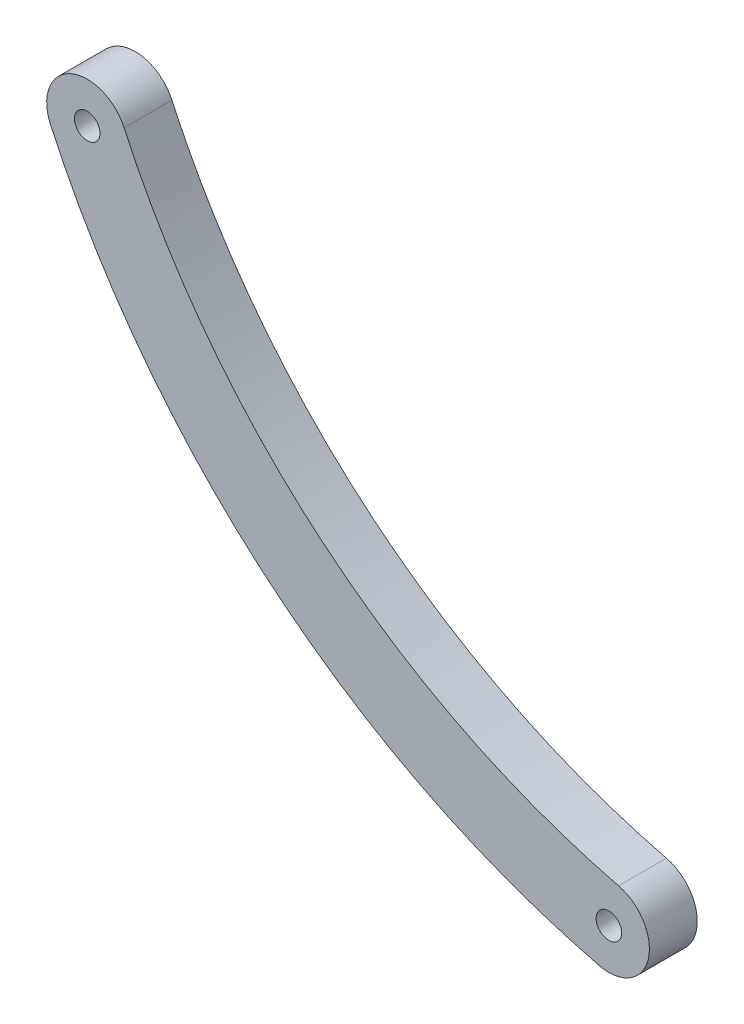
ISO-10303-21;
HEADER;
FILE_DESCRIPTION(('STEP AP214'),'2;1');
FILE_NAME('part.step','',(''),(''),'','','');
FILE_SCHEMA(('AUTOMOTIVE_DESIGN { 1 0 10303 214 1 1 1 1 }'));
ENDSEC;
DATA;
#1=APPLICATION_CONTEXT('core data for automotive mechanical design processes');
#2=APPLICATION_PROTOCOL_DEFINITION('international standard','automotive_design',2000,#1);
#3=PRODUCT_CONTEXT('',#1,'mechanical');
#4=PRODUCT('Part','Part','',(#3));
#5=PRODUCT_RELATED_PRODUCT_CATEGORY('part','',(#4));
#6=PRODUCT_DEFINITION_FORMATION('','',#4);
#7=PRODUCT_DEFINITION_CONTEXT('part definition',#1,'design');
#8=PRODUCT_DEFINITION('design','',#6,#7);
#9=PRODUCT_DEFINITION_SHAPE('','',#8);
#10=(LENGTH_UNIT() NAMED_UNIT(*) SI_UNIT(.MILLI.,.METRE.));
#11=(NAMED_UNIT(*) PLANE_ANGLE_UNIT() SI_UNIT($,.RADIAN.));
#12=(NAMED_UNIT(*) SI_UNIT($,.STERADIAN.) SOLID_ANGLE_UNIT());
#13=UNCERTAINTY_MEASURE_WITH_UNIT(LENGTH_MEASURE(1.E-05),#10,'distance_accuracy_value','');
#14=(GEOMETRIC_REPRESENTATION_CONTEXT(3) GLOBAL_UNCERTAINTY_ASSIGNED_CONTEXT((#13)) GLOBAL_UNIT_ASSIGNED_CONTEXT((#10,
#11,#12)) REPRESENTATION_CONTEXT('',''));
#15=CARTESIAN_POINT('',(0.,0.,0.));
#16=DIRECTION('',(0.,0.,1.));
#17=DIRECTION('',(1.,0.,0.));
#18=AXIS2_PLACEMENT_3D('',#15,#16,#17);
#19=CARTESIAN_POINT('',(198.044221934487,188.107028272022,5.9944));
#20=DIRECTION('',(0.,0.,1.));
#21=DIRECTION('',(1.,0.,0.));
#22=AXIS2_PLACEMENT_3D('',#19,#20,#21);
#23=PLANE('',#22);
#24=CARTESIAN_POINT('',(153.726206500026,167.826140047074,5.9944));
#25=DIRECTION('',(0.,0.,1.));
#26=DIRECTION('',(1.,0.,0.));
#27=AXIS2_PLACEMENT_3D('',#24,#25,#26);
#28=CIRCLE('',#27,1.60000000000066);
#29=CARTESIAN_POINT('',(155.326206500027,167.826140047074,5.9944));
#30=VERTEX_POINT('',#29);
#31=EDGE_CURVE('E99',#30,#30,#28,.T.);
#32=ORIENTED_EDGE('',*,*,#31,.F.);
#33=EDGE_LOOP('',(#32));
#34=FACE_BOUND('',#33,.T.);
#35=CARTESIAN_POINT('',(153.726206500026,167.826140047074,5.9944));
#36=DIRECTION('',(0.,0.,1.));
#37=DIRECTION('',(1.,0.,0.));
#38=AXIS2_PLACEMENT_3D('',#35,#36,#37);
#39=CIRCLE('',#38,5.08);
#40=CARTESIAN_POINT('',(158.345499992818,169.940029265423,5.9944));
#41=VERTEX_POINT('',#40);
#42=CARTESIAN_POINT('',(149.106913007235,165.712250828725,5.9944));
#43=VERTEX_POINT('',#42);
#44=EDGE_CURVE('E84',#41,#43,#39,.T.);
#45=ORIENTED_EDGE('',*,*,#44,.T.);
#46=CARTESIAN_POINT('',(242.362237368947,208.387916496971,5.9944));
#47=DIRECTION('',(0.,0.,1.));
#48=DIRECTION('',(1.,0.,0.));
#49=AXIS2_PLACEMENT_3D('',#46,#47,#48);
#50=CIRCLE('',#49,102.556169790198);
#51=CARTESIAN_POINT('',(217.866778032363,108.800063653736,5.9944));
#52=VERTEX_POINT('',#51);
#53=EDGE_CURVE('E79',#43,#52,#50,.T.);
#54=ORIENTED_EDGE('',*,*,#53,.T.);
#55=CARTESIAN_POINT('',(219.080131979613,113.733031543221,5.9944));
#56=DIRECTION('',(0.,0.,1.));
#57=DIRECTION('',(1.,0.,0.));
#58=AXIS2_PLACEMENT_3D('',#55,#56,#57);
#59=CIRCLE('',#58,5.08000000000001);
#60=CARTESIAN_POINT('',(220.293485926864,118.665999432706,5.9944));
#61=VERTEX_POINT('',#60);
#62=EDGE_CURVE('E82',#52,#61,#59,.T.);
#63=ORIENTED_EDGE('',*,*,#62,.T.);
#64=CARTESIAN_POINT('',(242.362237368947,208.387916496971,5.9944));
#65=DIRECTION('',(0.,0.,-1.));
#66=DIRECTION('',(1.,0.,0.));
#67=AXIS2_PLACEMENT_3D('',#64,#65,#66);
#68=CIRCLE('',#67,92.3961697901981);
#69=EDGE_CURVE('E49',#61,#41,#68,.T.);
#70=ORIENTED_EDGE('',*,*,#69,.T.);
#71=EDGE_LOOP('',(#45,#54,#63,#70));
#72=FACE_BOUND('',#71,.T.);
#73=CARTESIAN_POINT('',(219.080131979613,113.733031543221,5.9944));
#74=DIRECTION('',(0.,0.,1.));
#75=DIRECTION('',(1.,0.,0.));
#76=AXIS2_PLACEMENT_3D('',#73,#74,#75);
#77=CIRCLE('',#76,1.59999997498833);
#78=CARTESIAN_POINT('',(220.680131954602,113.733031543221,5.9944));
#79=VERTEX_POINT('',#78);
#80=EDGE_CURVE('E114',#79,#79,#77,.T.);
#81=ORIENTED_EDGE('',*,*,#80,.F.);
#82=EDGE_LOOP('',(#81));
#83=FACE_BOUND('',#82,.T.);
#84=ADVANCED_FACE('F32',(#34,#72,#83),#23,.T.);
#85=CARTESIAN_POINT('',(198.044221934487,188.107028272022,0.));
#86=DIRECTION('',(0.,0.,1.));
#87=DIRECTION('',(1.,0.,0.));
#88=AXIS2_PLACEMENT_3D('',#85,#86,#87);
#89=PLANE('',#88);
#90=CARTESIAN_POINT('',(153.726206500026,167.826140047074,0.));
#91=DIRECTION('',(0.,0.,1.));
#92=DIRECTION('',(1.,0.,0.));
#93=AXIS2_PLACEMENT_3D('',#90,#91,#92);
#94=CIRCLE('',#93,5.08);
#95=CARTESIAN_POINT('',(158.345499992818,169.940029265423,0.));
#96=VERTEX_POINT('',#95);
#97=CARTESIAN_POINT('',(149.106913007235,165.712250828725,0.));
#98=VERTEX_POINT('',#97);
#99=EDGE_CURVE('E96',#96,#98,#94,.T.);
#100=ORIENTED_EDGE('',*,*,#99,.F.);
#101=CARTESIAN_POINT('',(242.362237368947,208.387916496971,0.));
#102=DIRECTION('',(0.,0.,-1.));
#103=DIRECTION('',(1.,0.,0.));
#104=AXIS2_PLACEMENT_3D('',#101,#102,#103);
#105=CIRCLE('',#104,92.3961697901981);
#106=CARTESIAN_POINT('',(220.293485926864,118.665999432706,0.));
#107=VERTEX_POINT('',#106);
#108=EDGE_CURVE('E72',#107,#96,#105,.T.);
#109=ORIENTED_EDGE('',*,*,#108,.F.);
#110=CARTESIAN_POINT('',(219.080131979613,113.733031543221,0.));
#111=DIRECTION('',(0.,0.,1.));
#112=DIRECTION('',(1.,0.,0.));
#113=AXIS2_PLACEMENT_3D('',#110,#111,#112);
#114=CIRCLE('',#113,5.08000000000001);
#115=CARTESIAN_POINT('',(217.866778032363,108.800063653736,0.));
#116=VERTEX_POINT('',#115);
#117=EDGE_CURVE('E66',#116,#107,#114,.T.);
#118=ORIENTED_EDGE('',*,*,#117,.F.);
#119=CARTESIAN_POINT('',(242.362237368947,208.387916496971,0.));
#120=DIRECTION('',(0.,0.,1.));
#121=DIRECTION('',(1.,0.,0.));
#122=AXIS2_PLACEMENT_3D('',#119,#120,#121);
#123=CIRCLE('',#122,102.556169790198);
#124=EDGE_CURVE('E88',#98,#116,#123,.T.);
#125=ORIENTED_EDGE('',*,*,#124,.F.);
#126=EDGE_LOOP('',(#100,#109,#118,#125));
#127=FACE_BOUND('',#126,.T.);
#128=CARTESIAN_POINT('',(153.726206500026,167.826140047074,0.));
#129=DIRECTION('',(0.,0.,1.));
#130=DIRECTION('',(1.,0.,0.));
#131=AXIS2_PLACEMENT_3D('',#128,#129,#130);
#132=CIRCLE('',#131,1.60000000000066);
#133=CARTESIAN_POINT('',(155.326206500027,167.826140047074,0.));
#134=VERTEX_POINT('',#133);
#135=EDGE_CURVE('E111',#134,#134,#132,.T.);
#136=ORIENTED_EDGE('',*,*,#135,.T.);
#137=EDGE_LOOP('',(#136));
#138=FACE_BOUND('',#137,.T.);
#139=CARTESIAN_POINT('',(219.080131979613,113.733031543221,0.));
#140=DIRECTION('',(0.,0.,1.));
#141=DIRECTION('',(1.,0.,0.));
#142=AXIS2_PLACEMENT_3D('',#139,#140,#141);
#143=CIRCLE('',#142,1.59999997498833);
#144=CARTESIAN_POINT('',(220.680131954602,113.733031543221,0.));
#145=VERTEX_POINT('',#144);
#146=EDGE_CURVE('E117',#145,#145,#143,.T.);
#147=ORIENTED_EDGE('',*,*,#146,.T.);
#148=EDGE_LOOP('',(#147));
#149=FACE_BOUND('',#148,.T.);
#150=ADVANCED_FACE('F107',(#127,#138,#149),#89,.F.);
#151=CARTESIAN_POINT('',(153.726206500026,167.826140047074,5.9944));
#152=DIRECTION('',(0.,0.,-1.));
#153=DIRECTION('',(-1.,0.,0.));
#154=AXIS2_PLACEMENT_3D('',#151,#152,#153);
#155=CYLINDRICAL_SURFACE('',#154,5.08);
#156=ORIENTED_EDGE('',*,*,#99,.T.);
#157=DIRECTION('',(0.,0.,-1.));
#158=VECTOR('',#157,1.);
#159=CARTESIAN_POINT('',(149.106913007235,165.712250828725,5.9944));
#160=LINE('',#159,#158);
#161=EDGE_CURVE('E11',#43,#98,#160,.T.);
#162=ORIENTED_EDGE('',*,*,#161,.F.);
#163=ORIENTED_EDGE('',*,*,#44,.F.);
#164=DIRECTION('',(0.,0.,-1.));
#165=VECTOR('',#164,1.);
#166=CARTESIAN_POINT('',(158.345499992818,169.940029265423,5.9944));
#167=LINE('',#166,#165);
#168=EDGE_CURVE('E92',#41,#96,#167,.T.);
#169=ORIENTED_EDGE('',*,*,#168,.T.);
#170=EDGE_LOOP('',(#156,#162,#163,#169));
#171=FACE_BOUND('',#170,.T.);
#172=ADVANCED_FACE('F34',(#171),#155,.T.);
#173=CARTESIAN_POINT('',(242.362237368947,208.387916496971,5.9944));
#174=DIRECTION('',(0.,0.,-1.));
#175=DIRECTION('',(-1.,0.,0.));
#176=AXIS2_PLACEMENT_3D('',#173,#174,#175);
#177=CYLINDRICAL_SURFACE('',#176,102.556169790198);
#178=ORIENTED_EDGE('',*,*,#124,.T.);
#179=DIRECTION('',(0.,0.,-1.));
#180=VECTOR('',#179,1.);
#181=CARTESIAN_POINT('',(217.866778032363,108.800063653736,5.9944));
#182=LINE('',#181,#180);
#183=EDGE_CURVE('E41',#52,#116,#182,.T.);
#184=ORIENTED_EDGE('',*,*,#183,.F.);
#185=ORIENTED_EDGE('',*,*,#53,.F.);
#186=ORIENTED_EDGE('',*,*,#161,.T.);
#187=EDGE_LOOP('',(#178,#184,#185,#186));
#188=FACE_BOUND('',#187,.T.);
#189=ADVANCED_FACE('F87',(#188),#177,.T.);
#190=CARTESIAN_POINT('',(219.080131979613,113.733031543221,5.9944));
#191=DIRECTION('',(0.,0.,-1.));
#192=DIRECTION('',(-1.,0.,0.));
#193=AXIS2_PLACEMENT_3D('',#190,#191,#192);
#194=CYLINDRICAL_SURFACE('',#193,5.08000000000001);
#195=ORIENTED_EDGE('',*,*,#117,.T.);
#196=DIRECTION('',(0.,0.,-1.));
#197=VECTOR('',#196,1.);
#198=CARTESIAN_POINT('',(220.293485926864,118.665999432706,5.9944));
#199=LINE('',#198,#197);
#200=EDGE_CURVE('E89',#61,#107,#199,.T.);
#201=ORIENTED_EDGE('',*,*,#200,.F.);
#202=ORIENTED_EDGE('',*,*,#62,.F.);
#203=ORIENTED_EDGE('',*,*,#183,.T.);
#204=EDGE_LOOP('',(#195,#201,#202,#203));
#205=FACE_BOUND('',#204,.T.);
#206=ADVANCED_FACE('F90',(#205),#194,.T.);
#207=CARTESIAN_POINT('',(242.362237368947,208.387916496971,5.9944));
#208=DIRECTION('',(0.,0.,-1.));
#209=DIRECTION('',(-1.,0.,0.));
#210=AXIS2_PLACEMENT_3D('',#207,#208,#209);
#211=CYLINDRICAL_SURFACE('',#210,92.3961697901981);
#212=ORIENTED_EDGE('',*,*,#108,.T.);
#213=ORIENTED_EDGE('',*,*,#168,.F.);
#214=ORIENTED_EDGE('',*,*,#69,.F.);
#215=ORIENTED_EDGE('',*,*,#200,.T.);
#216=EDGE_LOOP('',(#212,#213,#214,#215));
#217=FACE_BOUND('',#216,.T.);
#218=ADVANCED_FACE('F104',(#217),#211,.F.);
#219=CARTESIAN_POINT('',(153.726206500026,167.826140047074,5.9944));
#220=DIRECTION('',(0.,0.,-1.));
#221=DIRECTION('',(-1.,0.,0.));
#222=AXIS2_PLACEMENT_3D('',#219,#220,#221);
#223=CYLINDRICAL_SURFACE('',#222,1.60000000000066);
#224=ORIENTED_EDGE('',*,*,#31,.T.);
#225=EDGE_LOOP('',(#224));
#226=FACE_BOUND('',#225,.T.);
#227=ORIENTED_EDGE('',*,*,#135,.F.);
#228=EDGE_LOOP('',(#227));
#229=FACE_BOUND('',#228,.T.);
#230=ADVANCED_FACE('F134',(#226,#229),#223,.F.);
#231=CARTESIAN_POINT('',(219.080131979613,113.733031543221,5.9944));
#232=DIRECTION('',(0.,0.,-1.));
#233=DIRECTION('',(-1.,0.,0.));
#234=AXIS2_PLACEMENT_3D('',#231,#232,#233);
#235=CYLINDRICAL_SURFACE('',#234,1.59999997498833);
#236=ORIENTED_EDGE('',*,*,#80,.T.);
#237=EDGE_LOOP('',(#236));
#238=FACE_BOUND('',#237,.T.);
#239=ORIENTED_EDGE('',*,*,#146,.F.);
#240=EDGE_LOOP('',(#239));
#241=FACE_BOUND('',#240,.T.);
#242=ADVANCED_FACE('F123',(#238,#241),#235,.F.);
#243=CLOSED_SHELL('',(#84,#150,#172,#189,#206,#218,#230,#242));
#244=MANIFOLD_SOLID_BREP('B2',#243);
#245=ADVANCED_BREP_SHAPE_REPRESENTATION('',(#18,#244),#14);
#246=SHAPE_DEFINITION_REPRESENTATION(#9,#245);
ENDSEC;
END-ISO-10303-21;
